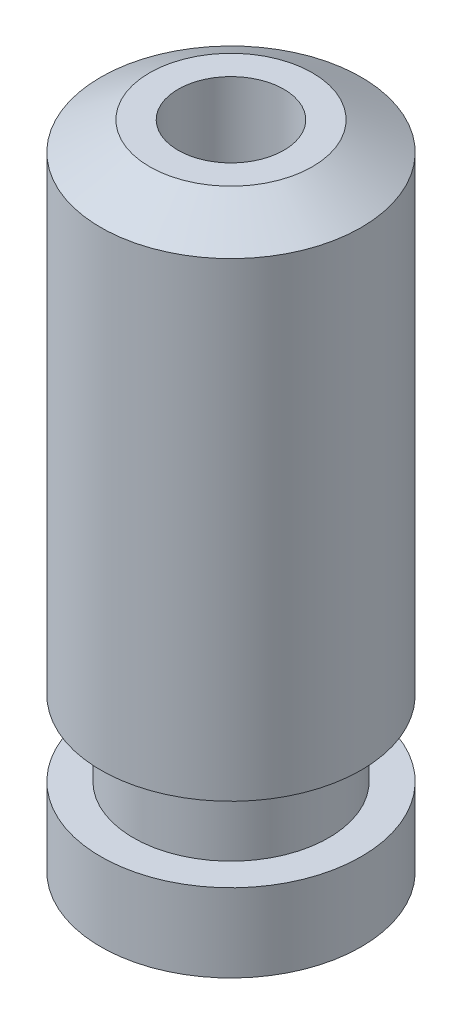
ISO-10303-21;
HEADER;
FILE_DESCRIPTION(('STEP AP214'),'2;1');
FILE_NAME('part.step','',(''),(''),'','','');
FILE_SCHEMA(('AUTOMOTIVE_DESIGN { 1 0 10303 214 1 1 1 1 }'));
ENDSEC;
DATA;
#1=APPLICATION_CONTEXT('core data for automotive mechanical design processes');
#2=APPLICATION_PROTOCOL_DEFINITION('international standard','automotive_design',2000,#1);
#3=PRODUCT_CONTEXT('',#1,'mechanical');
#4=PRODUCT('Part','Part','',(#3));
#5=PRODUCT_RELATED_PRODUCT_CATEGORY('part','',(#4));
#6=PRODUCT_DEFINITION_FORMATION('','',#4);
#7=PRODUCT_DEFINITION_CONTEXT('part definition',#1,'design');
#8=PRODUCT_DEFINITION('design','',#6,#7);
#9=PRODUCT_DEFINITION_SHAPE('','',#8);
#10=(LENGTH_UNIT() NAMED_UNIT(*) SI_UNIT(.MILLI.,.METRE.));
#11=(NAMED_UNIT(*) PLANE_ANGLE_UNIT() SI_UNIT($,.RADIAN.));
#12=(NAMED_UNIT(*) SI_UNIT($,.STERADIAN.) SOLID_ANGLE_UNIT());
#13=UNCERTAINTY_MEASURE_WITH_UNIT(LENGTH_MEASURE(1.E-05),#10,'distance_accuracy_value','');
#14=(GEOMETRIC_REPRESENTATION_CONTEXT(3) GLOBAL_UNCERTAINTY_ASSIGNED_CONTEXT((#13)) GLOBAL_UNIT_ASSIGNED_CONTEXT((#10,
#11,#12)) REPRESENTATION_CONTEXT('',''));
#15=CARTESIAN_POINT('',(0.,0.,0.));
#16=DIRECTION('',(0.,0.,1.));
#17=DIRECTION('',(1.,0.,0.));
#18=AXIS2_PLACEMENT_3D('',#15,#16,#17);
#19=CARTESIAN_POINT('',(0.,0.,0.));
#20=DIRECTION('',(0.,1.,0.));
#21=DIRECTION('',(-1.,0.,0.));
#22=AXIS2_PLACEMENT_3D('',#19,#20,#21);
#23=PLANE('',#22);
#24=CARTESIAN_POINT('',(0.,0.,0.));
#25=DIRECTION('',(0.,-1.,0.));
#26=DIRECTION('',(1.,0.,0.));
#27=AXIS2_PLACEMENT_3D('',#24,#25,#26);
#28=CIRCLE('',#27,3.25);
#29=CARTESIAN_POINT('',(3.25,0.,0.));
#30=VERTEX_POINT('',#29);
#31=EDGE_CURVE('E60',#30,#30,#28,.T.);
#32=ORIENTED_EDGE('',*,*,#31,.F.);
#33=EDGE_LOOP('',(#32));
#34=FACE_BOUND('',#33,.T.);
#35=CARTESIAN_POINT('',(0.,0.,0.));
#36=DIRECTION('',(0.,1.,0.));
#37=DIRECTION('',(-1.,0.,0.));
#38=AXIS2_PLACEMENT_3D('',#35,#36,#37);
#39=CIRCLE('',#38,8.);
#40=CARTESIAN_POINT('',(-8.,0.,0.));
#41=VERTEX_POINT('',#40);
#42=EDGE_CURVE('E10',#41,#41,#39,.T.);
#43=ORIENTED_EDGE('',*,*,#42,.F.);
#44=EDGE_LOOP('',(#43));
#45=FACE_BOUND('',#44,.T.);
#46=ADVANCED_FACE('F31',(#34,#45),#23,.F.);
#47=CARTESIAN_POINT('',(0.,40.,0.));
#48=DIRECTION('',(0.,1.,0.));
#49=DIRECTION('',(-1.,0.,0.));
#50=AXIS2_PLACEMENT_3D('',#47,#48,#49);
#51=CYLINDRICAL_SURFACE('',#50,8.);
#52=CARTESIAN_POINT('',(0.,4.8,0.));
#53=DIRECTION('',(0.,1.,0.));
#54=DIRECTION('',(-1.,0.,0.));
#55=AXIS2_PLACEMENT_3D('',#52,#53,#54);
#56=CIRCLE('',#55,8.);
#57=CARTESIAN_POINT('',(-8.,4.8,0.));
#58=VERTEX_POINT('',#57);
#59=EDGE_CURVE('E37',#58,#58,#56,.T.);
#60=ORIENTED_EDGE('',*,*,#59,.F.);
#61=EDGE_LOOP('',(#60));
#62=FACE_BOUND('',#61,.T.);
#63=ORIENTED_EDGE('',*,*,#42,.T.);
#64=EDGE_LOOP('',(#63));
#65=FACE_BOUND('',#64,.T.);
#66=ADVANCED_FACE('F77',(#62,#65),#51,.T.);
#67=CARTESIAN_POINT('',(8.,4.8,0.));
#68=DIRECTION('',(0.,-1.,0.));
#69=DIRECTION('',(1.,0.,0.));
#70=AXIS2_PLACEMENT_3D('',#67,#68,#69);
#71=PLANE('',#70);
#72=CARTESIAN_POINT('',(0.,4.8,0.));
#73=DIRECTION('',(0.,1.,0.));
#74=DIRECTION('',(-1.,0.,0.));
#75=AXIS2_PLACEMENT_3D('',#72,#73,#74);
#76=CIRCLE('',#75,6.00000000000001);
#77=CARTESIAN_POINT('',(-6.00000000000001,4.8,0.));
#78=VERTEX_POINT('',#77);
#79=EDGE_CURVE('E41',#78,#78,#76,.T.);
#80=ORIENTED_EDGE('',*,*,#79,.F.);
#81=EDGE_LOOP('',(#80));
#82=FACE_BOUND('',#81,.T.);
#83=ORIENTED_EDGE('',*,*,#59,.T.);
#84=EDGE_LOOP('',(#83));
#85=FACE_BOUND('',#84,.T.);
#86=ADVANCED_FACE('F81',(#82,#85),#71,.F.);
#87=CARTESIAN_POINT('',(0.,40.,0.));
#88=DIRECTION('',(0.,1.,0.));
#89=DIRECTION('',(-1.,0.,0.));
#90=AXIS2_PLACEMENT_3D('',#87,#88,#89);
#91=CYLINDRICAL_SURFACE('',#90,6.00000000000001);
#92=CARTESIAN_POINT('',(0.,9.4,0.));
#93=DIRECTION('',(0.,1.,0.));
#94=DIRECTION('',(-1.,0.,0.));
#95=AXIS2_PLACEMENT_3D('',#92,#93,#94);
#96=CIRCLE('',#95,6.00000000000001);
#97=CARTESIAN_POINT('',(-6.00000000000001,9.4,0.));
#98=VERTEX_POINT('',#97);
#99=EDGE_CURVE('E45',#98,#98,#96,.T.);
#100=ORIENTED_EDGE('',*,*,#99,.F.);
#101=EDGE_LOOP('',(#100));
#102=FACE_BOUND('',#101,.T.);
#103=ORIENTED_EDGE('',*,*,#79,.T.);
#104=EDGE_LOOP('',(#103));
#105=FACE_BOUND('',#104,.T.);
#106=ADVANCED_FACE('F86',(#102,#105),#91,.T.);
#107=CARTESIAN_POINT('',(6.00000000000001,9.4,0.));
#108=DIRECTION('',(0.,1.,0.));
#109=DIRECTION('',(-1.,0.,0.));
#110=AXIS2_PLACEMENT_3D('',#107,#108,#109);
#111=PLANE('',#110);
#112=CARTESIAN_POINT('',(0.,9.4,0.));
#113=DIRECTION('',(0.,1.,0.));
#114=DIRECTION('',(-1.,0.,0.));
#115=AXIS2_PLACEMENT_3D('',#112,#113,#114);
#116=CIRCLE('',#115,8.00000000000001);
#117=CARTESIAN_POINT('',(-8.00000000000001,9.4,0.));
#118=VERTEX_POINT('',#117);
#119=EDGE_CURVE('E50',#118,#118,#116,.T.);
#120=ORIENTED_EDGE('',*,*,#119,.F.);
#121=EDGE_LOOP('',(#120));
#122=FACE_BOUND('',#121,.T.);
#123=ORIENTED_EDGE('',*,*,#99,.T.);
#124=EDGE_LOOP('',(#123));
#125=FACE_BOUND('',#124,.T.);
#126=ADVANCED_FACE('F92',(#122,#125),#111,.F.);
#127=CARTESIAN_POINT('',(0.,40.,0.));
#128=DIRECTION('',(0.,1.,0.));
#129=DIRECTION('',(-1.,0.,0.));
#130=AXIS2_PLACEMENT_3D('',#127,#128,#129);
#131=CYLINDRICAL_SURFACE('',#130,8.);
#132=CARTESIAN_POINT('',(0.,38.2679491924311,0.));
#133=DIRECTION('',(0.,1.,0.));
#134=DIRECTION('',(-1.,0.,0.));
#135=AXIS2_PLACEMENT_3D('',#132,#133,#134);
#136=CIRCLE('',#135,7.99999999999999);
#137=CARTESIAN_POINT('',(-7.99999999999999,38.2679491924311,0.));
#138=VERTEX_POINT('',#137);
#139=EDGE_CURVE('E53',#138,#138,#136,.T.);
#140=ORIENTED_EDGE('',*,*,#139,.F.);
#141=EDGE_LOOP('',(#140));
#142=FACE_BOUND('',#141,.T.);
#143=ORIENTED_EDGE('',*,*,#119,.T.);
#144=EDGE_LOOP('',(#143));
#145=FACE_BOUND('',#144,.T.);
#146=ADVANCED_FACE('F96',(#142,#145),#131,.T.);
#147=CARTESIAN_POINT('',(0.,38.2679491924311,0.));
#148=DIRECTION('',(0.,-1.,0.));
#149=DIRECTION('',(1.,0.,0.));
#150=AXIS2_PLACEMENT_3D('',#147,#148,#149);
#151=CONICAL_SURFACE('',#150,7.99999999999999,1.0471975511966);
#152=CARTESIAN_POINT('',(0.,40.,0.));
#153=DIRECTION('',(0.,1.,0.));
#154=DIRECTION('',(-1.,0.,0.));
#155=AXIS2_PLACEMENT_3D('',#152,#153,#154);
#156=CIRCLE('',#155,5.);
#157=CARTESIAN_POINT('',(-4.99999999999999,40.,0.));
#158=VERTEX_POINT('',#157);
#159=EDGE_CURVE('E56',#158,#158,#156,.T.);
#160=ORIENTED_EDGE('',*,*,#159,.F.);
#161=EDGE_LOOP('',(#160));
#162=FACE_BOUND('',#161,.T.);
#163=ORIENTED_EDGE('',*,*,#139,.T.);
#164=EDGE_LOOP('',(#163));
#165=FACE_BOUND('',#164,.T.);
#166=ADVANCED_FACE('F100',(#162,#165),#151,.T.);
#167=CARTESIAN_POINT('',(0.,40.,0.));
#168=DIRECTION('',(0.,-1.,0.));
#169=DIRECTION('',(1.,0.,0.));
#170=AXIS2_PLACEMENT_3D('',#167,#168,#169);
#171=PLANE('',#170);
#172=CARTESIAN_POINT('',(0.,40.,0.));
#173=DIRECTION('',(0.,-1.,0.));
#174=DIRECTION('',(1.,0.,0.));
#175=AXIS2_PLACEMENT_3D('',#172,#173,#174);
#176=CIRCLE('',#175,3.25);
#177=CARTESIAN_POINT('',(3.25,40.,0.));
#178=VERTEX_POINT('',#177);
#179=EDGE_CURVE('E59',#178,#178,#176,.T.);
#180=ORIENTED_EDGE('',*,*,#179,.T.);
#181=EDGE_LOOP('',(#180));
#182=FACE_BOUND('',#181,.T.);
#183=ORIENTED_EDGE('',*,*,#159,.T.);
#184=EDGE_LOOP('',(#183));
#185=FACE_BOUND('',#184,.T.);
#186=ADVANCED_FACE('F66',(#182,#185),#171,.F.);
#187=CARTESIAN_POINT('',(0.,40.,0.));
#188=DIRECTION('',(0.,-1.,0.));
#189=DIRECTION('',(1.,0.,0.));
#190=AXIS2_PLACEMENT_3D('',#187,#188,#189);
#191=CYLINDRICAL_SURFACE('',#190,3.25);
#192=ORIENTED_EDGE('',*,*,#179,.F.);
#193=EDGE_LOOP('',(#192));
#194=FACE_BOUND('',#193,.T.);
#195=ORIENTED_EDGE('',*,*,#31,.T.);
#196=EDGE_LOOP('',(#195));
#197=FACE_BOUND('',#196,.T.);
#198=ADVANCED_FACE('F69',(#194,#197),#191,.F.);
#199=CLOSED_SHELL('',(#46,#66,#86,#106,#126,#146,#166,#186,#198));
#200=MANIFOLD_SOLID_BREP('B2',#199);
#201=ADVANCED_BREP_SHAPE_REPRESENTATION('',(#18,#200),#14);
#202=SHAPE_DEFINITION_REPRESENTATION(#9,#201);
ENDSEC;
END-ISO-10303-21;
